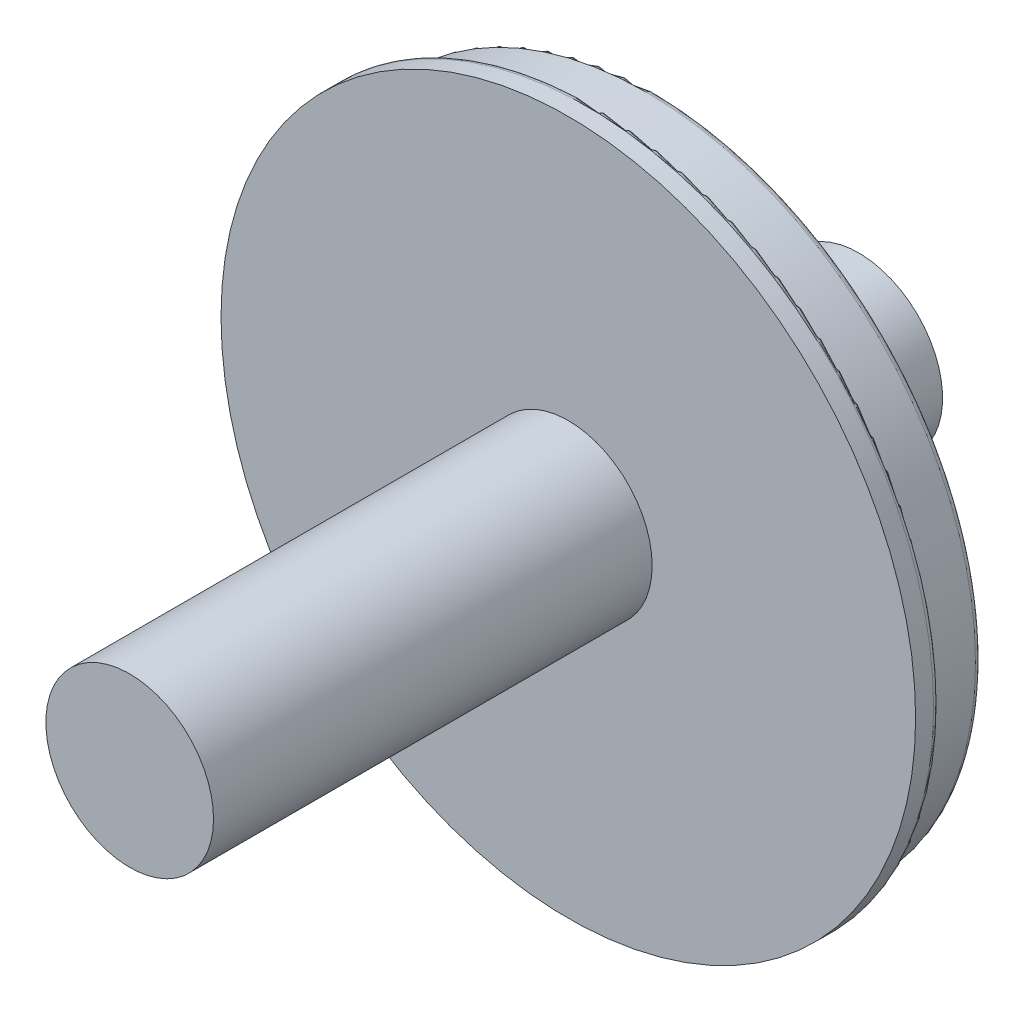
ISO-10303-21;
HEADER;
FILE_DESCRIPTION(('STEP AP214'),'2;1');
FILE_NAME('part.step','',(''),(''),'','','');
FILE_SCHEMA(('AUTOMOTIVE_DESIGN { 1 0 10303 214 1 1 1 1 }'));
ENDSEC;
DATA;
#1=APPLICATION_CONTEXT('core data for automotive mechanical design processes');
#2=APPLICATION_PROTOCOL_DEFINITION('international standard','automotive_design',2000,#1);
#3=PRODUCT_CONTEXT('',#1,'mechanical');
#4=PRODUCT('Part','Part','',(#3));
#5=PRODUCT_RELATED_PRODUCT_CATEGORY('part','',(#4));
#6=PRODUCT_DEFINITION_FORMATION('','',#4);
#7=PRODUCT_DEFINITION_CONTEXT('part definition',#1,'design');
#8=PRODUCT_DEFINITION('design','',#6,#7);
#9=PRODUCT_DEFINITION_SHAPE('','',#8);
#10=(LENGTH_UNIT() NAMED_UNIT(*) SI_UNIT(.MILLI.,.METRE.));
#11=(NAMED_UNIT(*) PLANE_ANGLE_UNIT() SI_UNIT($,.RADIAN.));
#12=(NAMED_UNIT(*) SI_UNIT($,.STERADIAN.) SOLID_ANGLE_UNIT());
#13=UNCERTAINTY_MEASURE_WITH_UNIT(LENGTH_MEASURE(1.E-05),#10,'distance_accuracy_value','');
#14=(GEOMETRIC_REPRESENTATION_CONTEXT(3) GLOBAL_UNCERTAINTY_ASSIGNED_CONTEXT((#13)) GLOBAL_UNIT_ASSIGNED_CONTEXT((#10,
#11,#12)) REPRESENTATION_CONTEXT('',''));
#15=CARTESIAN_POINT('',(0.,0.,0.));
#16=DIRECTION('',(0.,0.,1.));
#17=DIRECTION('',(1.,0.,0.));
#18=AXIS2_PLACEMENT_3D('',#15,#16,#17);
#19=CARTESIAN_POINT('',(0.,0.,-100.));
#20=DIRECTION('',(0.,0.,-1.));
#21=DIRECTION('',(-1.,0.,0.));
#22=AXIS2_PLACEMENT_3D('',#19,#20,#21);
#23=PLANE('',#22);
#24=CARTESIAN_POINT('',(0.,0.,-100.));
#25=DIRECTION('',(0.,0.,-1.));
#26=DIRECTION('',(-1.,0.,0.));
#27=AXIS2_PLACEMENT_3D('',#24,#25,#26);
#28=CIRCLE('',#27,540.);
#29=CARTESIAN_POINT('',(-540.,0.,-100.));
#30=VERTEX_POINT('',#29);
#31=EDGE_CURVE('E165',#30,#30,#28,.T.);
#32=ORIENTED_EDGE('',*,*,#31,.T.);
#33=EDGE_LOOP('',(#32));
#34=FACE_BOUND('',#33,.T.);
#35=CARTESIAN_POINT('',(-490.,-1.04083408558608E-13,-100.));
#36=CARTESIAN_POINT('',(-490.000111342747,12.3247823449047,-100.));
#37=CARTESIAN_POINT('',(-489.069167122449,36.9685710279418,-100.));
#38=CARTESIAN_POINT('',(-484.891838154981,73.7288245344231,-100.));
#39=CARTESIAN_POINT('',(-477.955067773229,110.067984184411,-100.));
#40=CARTESIAN_POINT('',(-468.297847444051,145.782311090985,-100.));
#41=CARTESIAN_POINT('',(-453.245442296029,188.405579285138,-100.));
#42=CARTESIAN_POINT('',(-430.443637835805,236.82771353946,-100.));
#43=CARTESIAN_POINT('',(-397.346826888669,288.937006762093,-100.));
#44=CARTESIAN_POINT('',(-363.210959781014,330.160390002647,-100.));
#45=CARTESIAN_POINT('',(-331.029617564425,361.904361051103,-100.));
#46=CARTESIAN_POINT('',(-302.808287105638,385.827860501999,-100.));
#47=CARTESIAN_POINT('',(-272.865029493054,407.554497192247,-100.));
#48=CARTESIAN_POINT('',(-241.367447733102,426.962691909799,-100.));
#49=CARTESIAN_POINT('',(-201.206620958107,447.709658451815,-100.));
#50=CARTESIAN_POINT('',(-151.428612900596,467.37423494517,-100.));
#51=CARTESIAN_POINT('',(-91.6199808477779,482.674236544527,-100.));
#52=CARTESIAN_POINT('',(-30.3610052860114,490.35408358034,-100.));
#53=CARTESIAN_POINT('',(31.376463845288,490.290051766809,-100.));
#54=CARTESIAN_POINT('',(92.6187097912888,482.483808462028,-100.));
#55=CARTESIAN_POINT('',(152.398311617721,467.058449088776,-100.));
#56=CARTESIAN_POINT('',(209.771354010387,444.257608272297,-100.));
#57=CARTESIAN_POINT('',(263.831815069229,414.441329834727,-100.));
#58=CARTESIAN_POINT('',(313.726012408706,378.080456955296,-100.));
#59=CARTESIAN_POINT('',(358.666046784766,335.749176617238,-100.));
#60=CARTESIAN_POINT('',(397.942254064668,288.115957848575,-100.));
#61=CARTESIAN_POINT('',(430.93440912402,235.932994225191,-100.));
#62=CARTESIAN_POINT('',(457.121520764732,180.024326096423,-100.));
#63=CARTESIAN_POINT('',(476.090058686549,121.27282775684,-100.));
#64=CARTESIAN_POINT('',(487.540483747245,60.6062656822127,-100.));
#65=CARTESIAN_POINT('',(491.291978081106,-1.01735217886534,-100.));
#66=CARTESIAN_POINT('',(487.285300464993,-62.6249046583955,-100.));
#67=CARTESIAN_POINT('',(475.583721813188,-123.243524282001,-100.));
#68=CARTESIAN_POINT('',(456.372026058602,-181.91596018007,-100.));
#69=CARTESIAN_POINT('',(429.953592105145,-237.71569437302,-100.));
#70=CARTESIAN_POINT('',(396.745603271574,-289.761572811282,-100.));
#71=CARTESIAN_POINT('',(357.272458607401,-337.231719798898,-100.));
#72=CARTESIAN_POINT('',(312.157494860291,-379.376517293469,-100.));
#73=CARTESIAN_POINT('',(262.113132144802,-415.530439566566,-100.));
#74=CARTESIAN_POINT('',(207.929664877151,-445.122573338526,-100.));
#75=CARTESIAN_POINT('',(150.462628848776,-467.68559381791,-100.));
#76=CARTESIAN_POINT('',(90.6198625133185,-482.863291671791,-100.));
#77=CARTESIAN_POINT('',(29.3450386068849,-490.415648427877,-100.));
#78=CARTESIAN_POINT('',(-32.3892796231522,-490.224677942098,-100.));
#79=CARTESIAN_POINT('',(-85.4668725924949,-483.346104018893,-100.));
#80=CARTESIAN_POINT('',(-129.484999400428,-473.06344189131,-100.));
#81=CARTESIAN_POINT('',(-164.775772604196,-461.957722372347,-100.));
#82=CARTESIAN_POINT('',(-199.127168930487,-448.223568324301,-100.));
#83=CARTESIAN_POINT('',(-232.34691957043,-431.937823482466,-100.));
#84=CARTESIAN_POINT('',(-271.320896603828,-409.03918583899,-100.));
#85=CARTESIAN_POINT('',(-314.510820828794,-377.428188447829,-100.));
#86=CARTESIAN_POINT('',(-359.358591001849,-335.008205370587,-100.));
#87=CARTESIAN_POINT('',(-393.32191787789,-293.642557159987,-100.));
#88=CARTESIAN_POINT('',(-418.351978746081,-256.001954327503,-100.));
#89=CARTESIAN_POINT('',(-436.459445802952,-223.73902315886,-100.));
#90=CARTESIAN_POINT('',(-452.08216288903,-190.204305618619,-100.));
#91=CARTESIAN_POINT('',(-465.132822880418,-155.58572771486,-100.));
#92=CARTESIAN_POINT('',(-477.751882677106,-112.530498018878,-100.));
#93=CARTESIAN_POINT('',(-487.499407421133,-60.6007209506204,-100.));
#94=CARTESIAN_POINT('',(-489.999817560517,-20.1946419710838,-100.));
#95=CARTESIAN_POINT('',(-490.,-1.04083408558608E-13,-100.));
#96=B_SPLINE_CURVE_WITH_KNOTS('',3,(#35,#36,#37,#38,#39,#40,#41,#42,#43,#44,#45,#46,#47,#48,#49,
#50,#51,#52,#53,#54,#55,#56,#57,#58,#59,#60,#61,#62,#63,#64,#65,#66,#67,#68,#69,#70,#71,#72,#73,
#74,#75,#76,#77,#78,#79,#80,#81,#82,#83,#84,#85,#86,#87,#88,#89,#90,#91,#92,#93,#94,#95),
.UNSPECIFIED.,.T.,.F.,(4,1,1,1,1,1,1,1,1,1,1,1,1,1,1,1,1,1,1,1,1,1,1,1,1,1,1,1,1,1,1,1,1,1,1,1,
1,1,1,1,1,1,1,1,1,1,1,1,1,1,1,1,1,1,1,1,1,1,4),(0.,0.012011675000536,0.024023503138238,
0.03603524705575,0.0480469695243445,0.0600587230276872,0.0800698634491821,0.100081003870677,
0.120092144292172,0.132103891906373,0.144115629390762,0.156127383036275,0.168139120500525,
0.18015086813125,0.200162008552745,0.22017314897424,0.240184289395735,0.26019542981723,
0.280206570238725,0.30021771066022,0.320228851081714,0.340239991503209,0.360251131924704,
0.380262272346199,0.400273412767694,0.420284553189189,0.440295693610684,0.460306834032179,
0.480317974453674,0.500329114875168,0.520340255296663,0.540351395718158,0.560362536139653,
0.580373676561148,0.600384816982643,0.620395957404138,0.640407097825633,0.660418238247128,
0.680429378668622,0.700440519090117,0.720451659511612,0.740462799933107,0.760473940354602,
0.780485080776097,0.792496828405941,0.804508565872909,0.816520319520469,0.828532056983282,
0.840543804616684,0.860554945038179,0.880566085459674,0.900577225881169,0.91258897205925,
0.924600713281063,0.936612469393395,0.948624183632665,0.960635950063634,0.980318396761861,1.),.UNSPECIFIED.);
#97=CARTESIAN_POINT('',(-490.,-1.04083408558608E-13,-100.));
#98=VERTEX_POINT('',#97);
#99=EDGE_CURVE('E13',#98,#98,#96,.T.);
#100=ORIENTED_EDGE('',*,*,#99,.F.);
#101=EDGE_LOOP('',(#100));
#102=FACE_BOUND('',#101,.T.);
#103=ADVANCED_FACE('F85',(#34,#102),#23,.T.);
#104=CARTESIAN_POINT('',(0.,0.,40.));
#105=DIRECTION('',(0.,0.,-1.));
#106=DIRECTION('',(-1.,0.,0.));
#107=AXIS2_PLACEMENT_3D('',#104,#105,#106);
#108=CYLINDRICAL_SURFACE('',#107,580.);
#109=CARTESIAN_POINT('',(0.,0.,10.));
#110=DIRECTION('',(0.,0.,1.));
#111=DIRECTION('',(1.,0.,0.));
#112=AXIS2_PLACEMENT_3D('',#109,#110,#111);
#113=CIRCLE('',#112,580.);
#114=CARTESIAN_POINT('',(580.,0.,10.));
#115=VERTEX_POINT('',#114);
#116=EDGE_CURVE('E176',#115,#115,#113,.T.);
#117=ORIENTED_EDGE('',*,*,#116,.T.);
#118=EDGE_LOOP('',(#117));
#119=FACE_BOUND('',#118,.T.);
#120=CARTESIAN_POINT('',(0.,0.,40.));
#121=DIRECTION('',(0.,0.,1.));
#122=DIRECTION('',(1.,0.,0.));
#123=AXIS2_PLACEMENT_3D('',#120,#121,#122);
#124=CIRCLE('',#123,580.);
#125=CARTESIAN_POINT('',(580.,0.,40.));
#126=VERTEX_POINT('',#125);
#127=EDGE_CURVE('E182',#126,#126,#124,.T.);
#128=ORIENTED_EDGE('',*,*,#127,.F.);
#129=EDGE_LOOP('',(#128));
#130=FACE_BOUND('',#129,.T.);
#131=ADVANCED_FACE('F154',(#119,#130),#108,.T.);
#132=CARTESIAN_POINT('',(0.,0.,40.));
#133=DIRECTION('',(0.,0.,1.));
#134=DIRECTION('',(1.,0.,0.));
#135=AXIS2_PLACEMENT_3D('',#132,#133,#134);
#136=PLANE('',#135);
#137=CARTESIAN_POINT('',(0.,0.,40.));
#138=DIRECTION('',(0.,0.,1.));
#139=DIRECTION('',(1.,0.,0.));
#140=AXIS2_PLACEMENT_3D('',#137,#138,#139);
#141=CIRCLE('',#140,140.);
#142=CARTESIAN_POINT('',(140.,0.,40.));
#143=VERTEX_POINT('',#142);
#144=EDGE_CURVE('E104',#143,#143,#141,.T.);
#145=ORIENTED_EDGE('',*,*,#144,.F.);
#146=EDGE_LOOP('',(#145));
#147=FACE_BOUND('',#146,.T.);
#148=ORIENTED_EDGE('',*,*,#127,.T.);
#149=EDGE_LOOP('',(#148));
#150=FACE_BOUND('',#149,.T.);
#151=ADVANCED_FACE('F159',(#147,#150),#136,.T.);
#152=CARTESIAN_POINT('',(0.,0.,0.));
#153=DIRECTION('',(0.,0.,1.));
#154=DIRECTION('',(1.,0.,0.));
#155=AXIS2_PLACEMENT_3D('',#152,#153,#154);
#156=PLANE('',#155);
#157=CARTESIAN_POINT('',(0.,0.,0.));
#158=DIRECTION('',(0.,0.,1.));
#159=DIRECTION('',(1.,0.,0.));
#160=AXIS2_PLACEMENT_3D('',#157,#158,#159);
#161=CIRCLE('',#160,570.);
#162=CARTESIAN_POINT('',(570.,0.,0.));
#163=VERTEX_POINT('',#162);
#164=EDGE_CURVE('E179',#163,#163,#161,.F.);
#165=ORIENTED_EDGE('',*,*,#164,.T.);
#166=EDGE_LOOP('',(#165));
#167=FACE_BOUND('',#166,.T.);
#168=CARTESIAN_POINT('',(0.,0.,0.));
#169=DIRECTION('',(0.,0.,1.));
#170=DIRECTION('',(1.,0.,0.));
#171=AXIS2_PLACEMENT_3D('',#168,#169,#170);
#172=CIRCLE('',#171,560.);
#173=CARTESIAN_POINT('',(560.,0.,0.));
#174=VERTEX_POINT('',#173);
#175=EDGE_CURVE('E174',#174,#174,#172,.T.);
#176=ORIENTED_EDGE('',*,*,#175,.T.);
#177=EDGE_LOOP('',(#176));
#178=FACE_BOUND('',#177,.T.);
#179=ADVANCED_FACE('F191',(#167,#178),#156,.F.);
#180=CARTESIAN_POINT('',(0.,0.,-100.));
#181=DIRECTION('',(0.,0.,1.));
#182=DIRECTION('',(1.,0.,0.));
#183=AXIS2_PLACEMENT_3D('',#180,#181,#182);
#184=CYLINDRICAL_SURFACE('',#183,550.);
#185=CARTESIAN_POINT('',(0.,0.,-90.));
#186=DIRECTION('',(0.,0.,-1.));
#187=DIRECTION('',(-1.,0.,0.));
#188=AXIS2_PLACEMENT_3D('',#185,#186,#187);
#189=CIRCLE('',#188,550.);
#190=CARTESIAN_POINT('',(-550.,0.,-90.));
#191=VERTEX_POINT('',#190);
#192=EDGE_CURVE('E171',#191,#191,#189,.F.);
#193=ORIENTED_EDGE('',*,*,#192,.T.);
#194=EDGE_LOOP('',(#193));
#195=FACE_BOUND('',#194,.T.);
#196=CARTESIAN_POINT('',(0.,0.,-9.99999999999999));
#197=DIRECTION('',(0.,0.,1.));
#198=DIRECTION('',(1.,0.,0.));
#199=AXIS2_PLACEMENT_3D('',#196,#197,#198);
#200=CIRCLE('',#199,550.);
#201=CARTESIAN_POINT('',(550.,0.,-9.99999999999999));
#202=VERTEX_POINT('',#201);
#203=EDGE_CURVE('E109',#202,#202,#200,.F.);
#204=ORIENTED_EDGE('',*,*,#203,.T.);
#205=EDGE_LOOP('',(#204));
#206=FACE_BOUND('',#205,.T.);
#207=ADVANCED_FACE('F197',(#195,#206),#184,.T.);
#208=CARTESIAN_POINT('',(0.,0.,10.));
#209=DIRECTION('',(0.,0.,1.));
#210=DIRECTION('',(1.,0.,0.));
#211=AXIS2_PLACEMENT_3D('',#208,#209,#210);
#212=TOROIDAL_SURFACE('',#211,570.,10.);
#213=ORIENTED_EDGE('',*,*,#164,.F.);
#214=EDGE_LOOP('',(#213));
#215=FACE_BOUND('',#214,.T.);
#216=ORIENTED_EDGE('',*,*,#116,.F.);
#217=EDGE_LOOP('',(#216));
#218=FACE_BOUND('',#217,.T.);
#219=ADVANCED_FACE('F203',(#215,#218),#212,.T.);
#220=CARTESIAN_POINT('',(0.,0.,-9.99999999999999));
#221=DIRECTION('',(0.,0.,1.));
#222=DIRECTION('',(1.,0.,0.));
#223=AXIS2_PLACEMENT_3D('',#220,#221,#222);
#224=TOROIDAL_SURFACE('',#223,560.,10.);
#225=ORIENTED_EDGE('',*,*,#175,.F.);
#226=EDGE_LOOP('',(#225));
#227=FACE_BOUND('',#226,.T.);
#228=ORIENTED_EDGE('',*,*,#203,.F.);
#229=EDGE_LOOP('',(#228));
#230=FACE_BOUND('',#229,.T.);
#231=ADVANCED_FACE('F211',(#227,#230),#224,.F.);
#232=CARTESIAN_POINT('',(0.,0.,-90.));
#233=DIRECTION('',(0.,0.,-1.));
#234=DIRECTION('',(-1.,0.,0.));
#235=AXIS2_PLACEMENT_3D('',#232,#233,#234);
#236=TOROIDAL_SURFACE('',#235,540.,10.);
#237=ORIENTED_EDGE('',*,*,#192,.F.);
#238=EDGE_LOOP('',(#237));
#239=FACE_BOUND('',#238,.T.);
#240=ORIENTED_EDGE('',*,*,#31,.F.);
#241=EDGE_LOOP('',(#240));
#242=FACE_BOUND('',#241,.T.);
#243=ADVANCED_FACE('F206',(#239,#242),#236,.T.);
#244=CARTESIAN_POINT('',(0.,0.,772.5));
#245=DIRECTION('',(0.,0.,-1.));
#246=DIRECTION('',(-1.,0.,0.));
#247=AXIS2_PLACEMENT_3D('',#244,#245,#246);
#248=CYLINDRICAL_SURFACE('',#247,140.);
#249=CARTESIAN_POINT('',(0.,0.,772.5));
#250=DIRECTION('',(0.,0.,1.));
#251=DIRECTION('',(1.,0.,0.));
#252=AXIS2_PLACEMENT_3D('',#249,#250,#251);
#253=CIRCLE('',#252,140.);
#254=CARTESIAN_POINT('',(140.,0.,772.5));
#255=VERTEX_POINT('',#254);
#256=EDGE_CURVE('E99',#255,#255,#253,.T.);
#257=ORIENTED_EDGE('',*,*,#256,.F.);
#258=EDGE_LOOP('',(#257));
#259=FACE_BOUND('',#258,.T.);
#260=ORIENTED_EDGE('',*,*,#144,.T.);
#261=EDGE_LOOP('',(#260));
#262=FACE_BOUND('',#261,.T.);
#263=ADVANCED_FACE('F152',(#259,#262),#248,.T.);
#264=CARTESIAN_POINT('',(0.,0.,772.5));
#265=DIRECTION('',(0.,0.,1.));
#266=DIRECTION('',(1.,0.,0.));
#267=AXIS2_PLACEMENT_3D('',#264,#265,#266);
#268=PLANE('',#267);
#269=ORIENTED_EDGE('',*,*,#256,.T.);
#270=EDGE_LOOP('',(#269));
#271=FACE_BOUND('',#270,.T.);
#272=ADVANCED_FACE('F127',(#271),#268,.T.);
#273=CARTESIAN_POINT('',(0.,0.,-80.));
#274=DIRECTION('',(0.,0.,-1.));
#275=DIRECTION('',(-1.,0.,0.));
#276=AXIS2_PLACEMENT_3D('',#273,#274,#275);
#277=PLANE('',#276);
#278=CARTESIAN_POINT('',(-490.,-1.04083408558608E-13,-80.0000000000001));
#279=CARTESIAN_POINT('',(-489.999817560517,-20.1946419710838,-80.0000000000001));
#280=CARTESIAN_POINT('',(-487.499407421133,-60.6007209506204,-80.0000000000001));
#281=CARTESIAN_POINT('',(-477.751882677106,-112.530498018878,-80.0000000000001));
#282=CARTESIAN_POINT('',(-465.132822880418,-155.58572771486,-80.0000000000001));
#283=CARTESIAN_POINT('',(-452.08216288903,-190.204305618619,-80.0000000000001));
#284=CARTESIAN_POINT('',(-436.459445802952,-223.73902315886,-80.0000000000001));
#285=CARTESIAN_POINT('',(-418.351978746081,-256.001954327503,-80.0000000000001));
#286=CARTESIAN_POINT('',(-393.32191787789,-293.642557159987,-80.0000000000001));
#287=CARTESIAN_POINT('',(-359.358591001849,-335.008205370587,-80.0000000000001));
#288=CARTESIAN_POINT('',(-314.510820828794,-377.428188447829,-80.0000000000001));
#289=CARTESIAN_POINT('',(-271.320896603828,-409.03918583899,-80.0000000000001));
#290=CARTESIAN_POINT('',(-232.34691957043,-431.937823482466,-80.0000000000001));
#291=CARTESIAN_POINT('',(-199.127168930487,-448.223568324301,-80.0000000000001));
#292=CARTESIAN_POINT('',(-164.775772604196,-461.957722372347,-80.0000000000001));
#293=CARTESIAN_POINT('',(-129.484999400428,-473.06344189131,-80.0000000000001));
#294=CARTESIAN_POINT('',(-85.4668725924949,-483.346104018893,-80.0000000000001));
#295=CARTESIAN_POINT('',(-32.3892796231522,-490.224677942098,-80.0000000000001));
#296=CARTESIAN_POINT('',(29.3450386068849,-490.415648427877,-80.0000000000001));
#297=CARTESIAN_POINT('',(90.6198625133185,-482.863291671791,-80.0000000000001));
#298=CARTESIAN_POINT('',(150.462628848776,-467.68559381791,-80.0000000000001));
#299=CARTESIAN_POINT('',(207.929664877151,-445.122573338526,-80.0000000000001));
#300=CARTESIAN_POINT('',(262.113132144802,-415.530439566566,-80.0000000000001));
#301=CARTESIAN_POINT('',(312.157494860291,-379.376517293469,-80.0000000000001));
#302=CARTESIAN_POINT('',(357.272458607401,-337.231719798898,-80.0000000000001));
#303=CARTESIAN_POINT('',(396.745603271574,-289.761572811282,-80.0000000000001));
#304=CARTESIAN_POINT('',(429.953592105145,-237.71569437302,-80.0000000000001));
#305=CARTESIAN_POINT('',(456.372026058602,-181.91596018007,-80.0000000000001));
#306=CARTESIAN_POINT('',(475.583721813188,-123.243524282001,-80.0000000000002));
#307=CARTESIAN_POINT('',(487.285300464993,-62.6249046583955,-80.0000000000001));
#308=CARTESIAN_POINT('',(491.291978081106,-1.01735217886534,-80.0000000000001));
#309=CARTESIAN_POINT('',(487.540483747245,60.6062656822127,-80.0000000000001));
#310=CARTESIAN_POINT('',(476.090058686549,121.27282775684,-80.0000000000001));
#311=CARTESIAN_POINT('',(457.121520764732,180.024326096423,-80.0000000000001));
#312=CARTESIAN_POINT('',(430.93440912402,235.932994225191,-80.0000000000001));
#313=CARTESIAN_POINT('',(397.942254064668,288.115957848575,-80.0000000000001));
#314=CARTESIAN_POINT('',(358.666046784766,335.749176617238,-80.0000000000001));
#315=CARTESIAN_POINT('',(313.726012408706,378.080456955296,-80.0000000000001));
#316=CARTESIAN_POINT('',(263.831815069229,414.441329834727,-80.0000000000001));
#317=CARTESIAN_POINT('',(209.771354010387,444.257608272297,-80.0000000000001));
#318=CARTESIAN_POINT('',(152.398311617721,467.058449088776,-80.0000000000001));
#319=CARTESIAN_POINT('',(92.6187097912888,482.483808462028,-80.0000000000001));
#320=CARTESIAN_POINT('',(31.376463845288,490.290051766809,-80.0000000000001));
#321=CARTESIAN_POINT('',(-30.3610052860114,490.35408358034,-80.0000000000001));
#322=CARTESIAN_POINT('',(-91.6199808477779,482.674236544527,-80.0000000000001));
#323=CARTESIAN_POINT('',(-151.428612900596,467.37423494517,-80.0000000000001));
#324=CARTESIAN_POINT('',(-201.206620958107,447.709658451815,-80.0000000000001));
#325=CARTESIAN_POINT('',(-241.367447733102,426.962691909799,-80.0000000000001));
#326=CARTESIAN_POINT('',(-272.865029493054,407.554497192247,-80.0000000000001));
#327=CARTESIAN_POINT('',(-302.808287105638,385.827860501999,-80.0000000000001));
#328=CARTESIAN_POINT('',(-331.029617564425,361.904361051103,-80.0000000000001));
#329=CARTESIAN_POINT('',(-363.210959781014,330.160390002647,-80.0000000000001));
#330=CARTESIAN_POINT('',(-397.346826888669,288.937006762093,-80.0000000000001));
#331=CARTESIAN_POINT('',(-430.443637835805,236.82771353946,-80.0000000000001));
#332=CARTESIAN_POINT('',(-453.245442296029,188.405579285138,-80.0000000000001));
#333=CARTESIAN_POINT('',(-468.297847444051,145.782311090985,-80.0000000000001));
#334=CARTESIAN_POINT('',(-477.955067773229,110.067984184411,-80.0000000000001));
#335=CARTESIAN_POINT('',(-484.891838154981,73.7288245344231,-80.0000000000001));
#336=CARTESIAN_POINT('',(-489.069167122449,36.9685710279418,-80.0000000000001));
#337=CARTESIAN_POINT('',(-490.000111342747,12.3247823449047,-80.0000000000001));
#338=CARTESIAN_POINT('',(-490.,-1.04083408558608E-13,-80.0000000000001));
#339=B_SPLINE_CURVE_WITH_KNOTS('',3,(#278,#279,#280,#281,#282,#283,#284,#285,#286,#287,#288,
#289,#290,#291,#292,#293,#294,#295,#296,#297,#298,#299,#300,#301,#302,#303,#304,#305,#306,#307,
#308,#309,#310,#311,#312,#313,#314,#315,#316,#317,#318,#319,#320,#321,#322,#323,#324,#325,#326,
#327,#328,#329,#330,#331,#332,#333,#334,#335,#336,#337,#338),.UNSPECIFIED.,.T.,.F.,(4,1,1,1,1,1,
1,1,1,1,1,1,1,1,1,1,1,1,1,1,1,1,1,1,1,1,1,1,1,1,1,1,1,1,1,1,1,1,1,1,1,1,1,1,1,1,1,1,1,1,1,1,1,1,
1,1,1,1,4),(0.,0.0196816032381394,0.0393640499363657,0.0513758163673351,0.0633875306066053,
0.0753992867189369,0.0874110279407503,0.099422774118831,0.119433914540326,0.139445054961821,
0.159456195383316,0.171467943016718,0.183479680479531,0.195491434127091,0.207503171594059,
0.219514919223903,0.239526059645398,0.259537200066893,0.279548340488388,0.299559480909883,
0.319570621331378,0.339581761752872,0.359592902174367,0.379604042595862,0.399615183017357,
0.419626323438852,0.439637463860347,0.459648604281842,0.479659744703337,0.499670885124832,
0.519682025546326,0.539693165967821,0.559704306389316,0.579715446810811,0.599726587232306,
0.619737727653801,0.639748868075296,0.659760008496791,0.679771148918286,0.69978228933978,
0.719793429761275,0.73980457018277,0.759815710604265,0.77982685102576,0.799837991447255,
0.81984913186875,0.831860879499475,0.843872616963725,0.855884370609238,0.867896108093627,
0.879907855707828,0.899918996129323,0.919930136550818,0.939941276972313,0.951953030475655,
0.96396475294425,0.975976496861762,0.987988324999464,1.),.UNSPECIFIED.);
#340=CARTESIAN_POINT('',(-490.,-1.04083408558608E-13,-80.0000000000001));
#341=VERTEX_POINT('',#340);
#342=EDGE_CURVE('E95',#341,#341,#339,.F.);
#343=ORIENTED_EDGE('',*,*,#342,.T.);
#344=EDGE_LOOP('',(#343));
#345=FACE_BOUND('',#344,.T.);
#346=ADVANCED_FACE('F117',(#345),#277,.T.);
#347=CARTESIAN_POINT('',(-490.,-1.04083408558608E-13,-100.));
#348=CARTESIAN_POINT('',(-490.000111342747,12.3247823449047,-100.));
#349=CARTESIAN_POINT('',(-489.069167122449,36.9685710279418,-100.));
#350=CARTESIAN_POINT('',(-484.891838154981,73.7288245344231,-100.));
#351=CARTESIAN_POINT('',(-477.955067773229,110.067984184411,-100.));
#352=CARTESIAN_POINT('',(-468.297847444051,145.782311090985,-100.));
#353=CARTESIAN_POINT('',(-453.245442296029,188.405579285138,-100.));
#354=CARTESIAN_POINT('',(-430.443637835805,236.82771353946,-100.));
#355=CARTESIAN_POINT('',(-397.346826888669,288.937006762093,-100.));
#356=CARTESIAN_POINT('',(-363.210959781014,330.160390002647,-100.));
#357=CARTESIAN_POINT('',(-331.029617564425,361.904361051103,-100.));
#358=CARTESIAN_POINT('',(-302.808287105638,385.827860501999,-100.));
#359=CARTESIAN_POINT('',(-272.865029493054,407.554497192247,-100.));
#360=CARTESIAN_POINT('',(-241.367447733102,426.962691909799,-100.));
#361=CARTESIAN_POINT('',(-201.206620958107,447.709658451815,-100.));
#362=CARTESIAN_POINT('',(-151.428612900596,467.37423494517,-100.));
#363=CARTESIAN_POINT('',(-91.6199808477779,482.674236544527,-100.));
#364=CARTESIAN_POINT('',(-30.3610052860114,490.35408358034,-100.));
#365=CARTESIAN_POINT('',(31.376463845288,490.290051766809,-100.));
#366=CARTESIAN_POINT('',(92.6187097912888,482.483808462028,-100.));
#367=CARTESIAN_POINT('',(152.398311617721,467.058449088776,-100.));
#368=CARTESIAN_POINT('',(209.771354010387,444.257608272297,-100.));
#369=CARTESIAN_POINT('',(263.831815069229,414.441329834727,-100.));
#370=CARTESIAN_POINT('',(313.726012408706,378.080456955296,-100.));
#371=CARTESIAN_POINT('',(358.666046784766,335.749176617238,-100.));
#372=CARTESIAN_POINT('',(397.942254064668,288.115957848575,-100.));
#373=CARTESIAN_POINT('',(430.93440912402,235.932994225191,-100.));
#374=CARTESIAN_POINT('',(457.121520764732,180.024326096423,-100.));
#375=CARTESIAN_POINT('',(476.090058686549,121.27282775684,-100.));
#376=CARTESIAN_POINT('',(487.540483747245,60.6062656822127,-100.));
#377=CARTESIAN_POINT('',(491.291978081106,-1.01735217886534,-100.));
#378=CARTESIAN_POINT('',(487.285300464993,-62.6249046583955,-100.));
#379=CARTESIAN_POINT('',(475.583721813188,-123.243524282001,-100.));
#380=CARTESIAN_POINT('',(456.372026058602,-181.91596018007,-100.));
#381=CARTESIAN_POINT('',(429.953592105145,-237.71569437302,-100.));
#382=CARTESIAN_POINT('',(396.745603271574,-289.761572811282,-100.));
#383=CARTESIAN_POINT('',(357.272458607401,-337.231719798898,-100.));
#384=CARTESIAN_POINT('',(312.157494860291,-379.376517293469,-100.));
#385=CARTESIAN_POINT('',(262.113132144802,-415.530439566566,-100.));
#386=CARTESIAN_POINT('',(207.929664877151,-445.122573338526,-100.));
#387=CARTESIAN_POINT('',(150.462628848776,-467.68559381791,-100.));
#388=CARTESIAN_POINT('',(90.6198625133185,-482.863291671791,-100.));
#389=CARTESIAN_POINT('',(29.3450386068849,-490.415648427877,-100.));
#390=CARTESIAN_POINT('',(-32.3892796231522,-490.224677942098,-100.));
#391=CARTESIAN_POINT('',(-85.4668725924949,-483.346104018893,-100.));
#392=CARTESIAN_POINT('',(-129.484999400428,-473.06344189131,-100.));
#393=CARTESIAN_POINT('',(-164.775772604196,-461.957722372347,-100.));
#394=CARTESIAN_POINT('',(-199.127168930487,-448.223568324301,-100.));
#395=CARTESIAN_POINT('',(-232.34691957043,-431.937823482466,-100.));
#396=CARTESIAN_POINT('',(-271.320896603828,-409.03918583899,-100.));
#397=CARTESIAN_POINT('',(-314.510820828794,-377.428188447829,-100.));
#398=CARTESIAN_POINT('',(-359.358591001849,-335.008205370587,-100.));
#399=CARTESIAN_POINT('',(-393.32191787789,-293.642557159987,-100.));
#400=CARTESIAN_POINT('',(-418.351978746081,-256.001954327503,-100.));
#401=CARTESIAN_POINT('',(-436.459445802952,-223.73902315886,-100.));
#402=CARTESIAN_POINT('',(-452.08216288903,-190.204305618619,-100.));
#403=CARTESIAN_POINT('',(-465.132822880418,-155.58572771486,-100.));
#404=CARTESIAN_POINT('',(-477.751882677106,-112.530498018878,-100.));
#405=CARTESIAN_POINT('',(-487.499407421133,-60.6007209506204,-100.));
#406=CARTESIAN_POINT('',(-489.999817560517,-20.1946419710838,-100.));
#407=CARTESIAN_POINT('',(-490.,-1.04083408558608E-13,-100.));
#408=B_SPLINE_CURVE_WITH_KNOTS('',3,(#347,#348,#349,#350,#351,#352,#353,#354,#355,#356,#357,
#358,#359,#360,#361,#362,#363,#364,#365,#366,#367,#368,#369,#370,#371,#372,#373,#374,#375,#376,
#377,#378,#379,#380,#381,#382,#383,#384,#385,#386,#387,#388,#389,#390,#391,#392,#393,#394,#395,
#396,#397,#398,#399,#400,#401,#402,#403,#404,#405,#406,#407),.UNSPECIFIED.,.T.,.F.,(4,1,1,1,1,1,
1,1,1,1,1,1,1,1,1,1,1,1,1,1,1,1,1,1,1,1,1,1,1,1,1,1,1,1,1,1,1,1,1,1,1,1,1,1,1,1,1,1,1,1,1,1,1,1,
1,1,1,1,4),(0.,0.012011675000536,0.024023503138238,0.03603524705575,0.0480469695243445,
0.0600587230276872,0.0800698634491821,0.100081003870677,0.120092144292172,0.132103891906373,
0.144115629390762,0.156127383036275,0.168139120500525,0.18015086813125,0.200162008552745,
0.22017314897424,0.240184289395735,0.26019542981723,0.280206570238725,0.30021771066022,
0.320228851081714,0.340239991503209,0.360251131924704,0.380262272346199,0.400273412767694,
0.420284553189189,0.440295693610684,0.460306834032179,0.480317974453674,0.500329114875168,
0.520340255296663,0.540351395718158,0.560362536139653,0.580373676561148,0.600384816982643,
0.620395957404138,0.640407097825633,0.660418238247128,0.680429378668622,0.700440519090117,
0.720451659511612,0.740462799933107,0.760473940354602,0.780485080776097,0.792496828405941,
0.804508565872909,0.816520319520469,0.828532056983282,0.840543804616684,0.860554945038179,
0.880566085459674,0.900577225881169,0.91258897205925,0.924600713281063,0.936612469393395,
0.948624183632665,0.960635950063634,0.980318396761861,1.),.UNSPECIFIED.);
#409=DIRECTION('',(0.,0.,1.));
#410=VECTOR('',#409,1.);
#411=SURFACE_OF_LINEAR_EXTRUSION('',#408,#410);
#412=ORIENTED_EDGE('',*,*,#99,.T.);
#413=EDGE_LOOP('',(#412));
#414=FACE_BOUND('',#413,.T.);
#415=ORIENTED_EDGE('',*,*,#342,.F.);
#416=EDGE_LOOP('',(#415));
#417=FACE_BOUND('',#416,.T.);
#418=ADVANCED_FACE('F126',(#414,#417),#411,.T.);
#419=CLOSED_SHELL('',(#103,#131,#151,#179,#207,#219,#231,#243,#263,#272,#346,#418));
#420=MANIFOLD_SOLID_BREP('B2',#419);
#421=CARTESIAN_POINT('',(0.,0.,-445.));
#422=DIRECTION('',(0.,0.,-1.));
#423=DIRECTION('',(-1.,0.,0.));
#424=AXIS2_PLACEMENT_3D('',#421,#422,#423);
#425=PLANE('',#424);
#426=CARTESIAN_POINT('',(0.,0.,-445.));
#427=DIRECTION('',(0.,0.,-1.));
#428=DIRECTION('',(-1.,0.,0.));
#429=AXIS2_PLACEMENT_3D('',#426,#427,#428);
#430=CIRCLE('',#429,140.);
#431=CARTESIAN_POINT('',(-140.,0.,-445.));
#432=VERTEX_POINT('',#431);
#433=EDGE_CURVE('E84',#432,#432,#430,.T.);
#434=ORIENTED_EDGE('',*,*,#433,.T.);
#435=EDGE_LOOP('',(#434));
#436=FACE_BOUND('',#435,.T.);
#437=ADVANCED_FACE('F333',(#436),#425,.T.);
#438=CARTESIAN_POINT('',(0.,0.,-445.));
#439=DIRECTION('',(0.,0.,1.));
#440=DIRECTION('',(1.,0.,0.));
#441=AXIS2_PLACEMENT_3D('',#438,#439,#440);
#442=CYLINDRICAL_SURFACE('',#441,140.);
#443=ORIENTED_EDGE('',*,*,#433,.F.);
#444=EDGE_LOOP('',(#443));
#445=FACE_BOUND('',#444,.T.);
#446=CARTESIAN_POINT('',(0.,0.,-100.));
#447=DIRECTION('',(0.,0.,-1.));
#448=DIRECTION('',(-1.,0.,0.));
#449=AXIS2_PLACEMENT_3D('',#446,#447,#448);
#450=CIRCLE('',#449,140.);
#451=CARTESIAN_POINT('',(-140.,0.,-100.));
#452=VERTEX_POINT('',#451);
#453=EDGE_CURVE('E340',#452,#452,#450,.T.);
#454=ORIENTED_EDGE('',*,*,#453,.T.);
#455=EDGE_LOOP('',(#454));
#456=FACE_BOUND('',#455,.T.);
#457=ADVANCED_FACE('F335',(#445,#456),#442,.T.);
#458=CARTESIAN_POINT('',(0.,0.,-100.));
#459=DIRECTION('',(0.,0.,-1.));
#460=DIRECTION('',(-1.,0.,0.));
#461=AXIS2_PLACEMENT_3D('',#458,#459,#460);
#462=PLANE('',#461);
#463=ORIENTED_EDGE('',*,*,#453,.F.);
#464=EDGE_LOOP('',(#463));
#465=FACE_BOUND('',#464,.T.);
#466=ADVANCED_FACE('F347',(#465),#462,.F.);
#467=CLOSED_SHELL('',(#437,#457,#466));
#468=MANIFOLD_SOLID_BREP('B8',#467);
#469=ADVANCED_BREP_SHAPE_REPRESENTATION('',(#18,#420,#468),#14);
#470=SHAPE_DEFINITION_REPRESENTATION(#9,#469);
ENDSEC;
END-ISO-10303-21;
